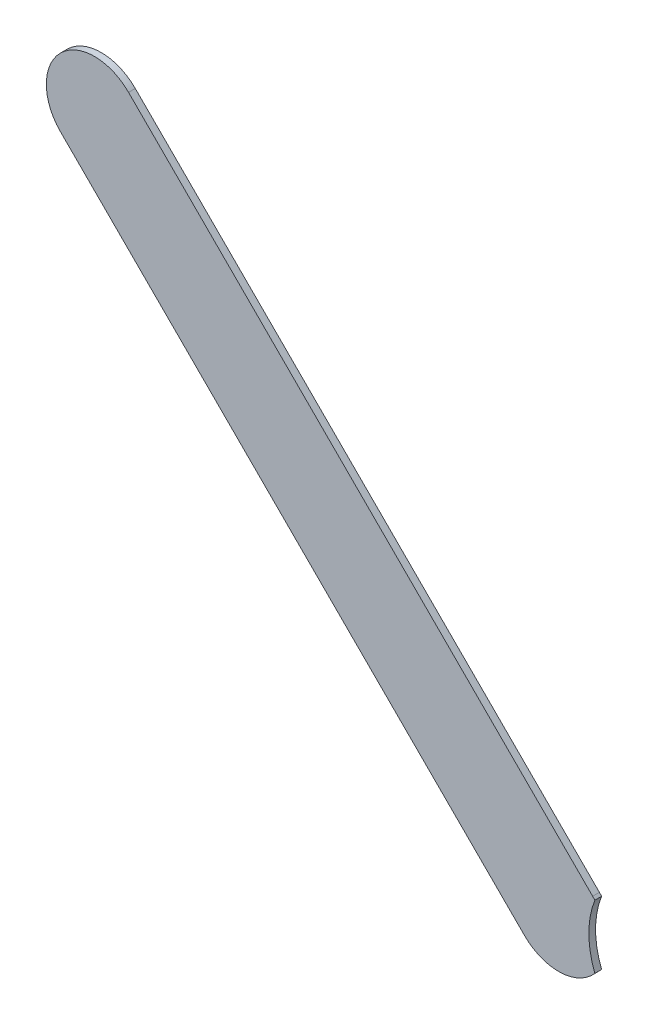
ISO-10303-21;
HEADER;
FILE_DESCRIPTION(('STEP AP214'),'2;1');
FILE_NAME('part.step','',(''),(''),'','','');
FILE_SCHEMA(('AUTOMOTIVE_DESIGN { 1 0 10303 214 1 1 1 1 }'));
ENDSEC;
DATA;
#1=APPLICATION_CONTEXT('core data for automotive mechanical design processes');
#2=APPLICATION_PROTOCOL_DEFINITION('international standard','automotive_design',2000,#1);
#3=PRODUCT_CONTEXT('',#1,'mechanical');
#4=PRODUCT('Part','Part','',(#3));
#5=PRODUCT_RELATED_PRODUCT_CATEGORY('part','',(#4));
#6=PRODUCT_DEFINITION_FORMATION('','',#4);
#7=PRODUCT_DEFINITION_CONTEXT('part definition',#1,'design');
#8=PRODUCT_DEFINITION('design','',#6,#7);
#9=PRODUCT_DEFINITION_SHAPE('','',#8);
#10=(LENGTH_UNIT() NAMED_UNIT(*) SI_UNIT(.MILLI.,.METRE.));
#11=(NAMED_UNIT(*) PLANE_ANGLE_UNIT() SI_UNIT($,.RADIAN.));
#12=(NAMED_UNIT(*) SI_UNIT($,.STERADIAN.) SOLID_ANGLE_UNIT());
#13=UNCERTAINTY_MEASURE_WITH_UNIT(LENGTH_MEASURE(1.E-05),#10,'distance_accuracy_value','');
#14=(GEOMETRIC_REPRESENTATION_CONTEXT(3) GLOBAL_UNCERTAINTY_ASSIGNED_CONTEXT((#13)) GLOBAL_UNIT_ASSIGNED_CONTEXT((#10,
#11,#12)) REPRESENTATION_CONTEXT('',''));
#15=CARTESIAN_POINT('',(0.,0.,0.));
#16=DIRECTION('',(0.,0.,1.));
#17=DIRECTION('',(1.,0.,0.));
#18=AXIS2_PLACEMENT_3D('',#15,#16,#17);
#19=CARTESIAN_POINT('',(176.6529995,-124.4559995,-0.035));
#20=DIRECTION('',(0.,0.,-1.));
#21=DIRECTION('',(-0.707106781186548,-0.707106781186548,0.));
#22=AXIS2_PLACEMENT_3D('',#19,#20,#21);
#23=CYLINDRICAL_SURFACE('',#22,0.249999723809);
#24=DIRECTION('',(0.,0.,1.));
#25=VECTOR('',#24,1.);
#26=CARTESIAN_POINT('',(176.829776,-124.279223,-0.035));
#27=LINE('',#26,#25);
#28=CARTESIAN_POINT('',(176.829776,-124.279223,-0.035));
#29=VERTEX_POINT('',#28);
#30=CARTESIAN_POINT('',(176.829776,-124.279223,0.));
#31=VERTEX_POINT('',#30);
#32=EDGE_CURVE('E27',#29,#31,#27,.T.);
#33=ORIENTED_EDGE('',*,*,#32,.T.);
#34=CARTESIAN_POINT('',(176.6529995,-124.4559995,0.));
#35=DIRECTION('',(0.,0.,1.));
#36=DIRECTION('',(-0.707106781186548,-0.707106781186548,0.));
#37=AXIS2_PLACEMENT_3D('',#34,#35,#36);
#38=CIRCLE('',#37,0.249999723809);
#39=CARTESIAN_POINT('',(176.84117861475,-124.2914137087,0.));
#40=VERTEX_POINT('',#39);
#41=EDGE_CURVE('E90',#40,#31,#38,.T.);
#42=ORIENTED_EDGE('',*,*,#41,.F.);
#43=DIRECTION('',(0.,0.,-1.));
#44=VECTOR('',#43,1.);
#45=CARTESIAN_POINT('',(176.84117861475,-124.2914137087,-0.035));
#46=LINE('',#45,#44);
#47=CARTESIAN_POINT('',(176.84117861475,-124.2914137087,-0.035));
#48=VERTEX_POINT('',#47);
#49=EDGE_CURVE('E11',#40,#48,#46,.T.);
#50=ORIENTED_EDGE('',*,*,#49,.T.);
#51=CARTESIAN_POINT('',(176.6529995,-124.4559995,-0.035));
#52=DIRECTION('',(0.,0.,1.));
#53=DIRECTION('',(-0.707106781186548,-0.707106781186548,0.));
#54=AXIS2_PLACEMENT_3D('',#51,#52,#53);
#55=CIRCLE('',#54,0.249999723809);
#56=EDGE_CURVE('E87',#48,#29,#55,.T.);
#57=ORIENTED_EDGE('',*,*,#56,.T.);
#58=EDGE_LOOP('',(#33,#42,#50,#57));
#59=FACE_BOUND('',#58,.T.);
#60=ADVANCED_FACE('F17',(#59),#23,.T.);
#61=CARTESIAN_POINT('',(177.26,-124.456,-0.045));
#62=DIRECTION('',(0.,0.,-1.));
#63=DIRECTION('',(0.,-1.,0.));
#64=AXIS2_PLACEMENT_3D('',#61,#62,#63);
#65=CYLINDRICAL_SURFACE('',#64,0.45);
#66=ORIENTED_EDGE('',*,*,#49,.F.);
#67=CARTESIAN_POINT('',(177.26,-124.456,0.));
#68=DIRECTION('',(0.,0.,-1.));
#69=DIRECTION('',(0.,-1.,0.));
#70=AXIS2_PLACEMENT_3D('',#67,#68,#69);
#71=CIRCLE('',#70,0.45);
#72=CARTESIAN_POINT('',(176.84117834361,-124.6205856012,0.));
#73=VERTEX_POINT('',#72);
#74=EDGE_CURVE('E97',#73,#40,#71,.T.);
#75=ORIENTED_EDGE('',*,*,#74,.F.);
#76=DIRECTION('',(0.,0.,-1.));
#77=VECTOR('',#76,1.);
#78=CARTESIAN_POINT('',(176.8411783436,-124.6205856012,-0.035));
#79=LINE('',#78,#77);
#80=CARTESIAN_POINT('',(176.84117834361,-124.6205856012,-0.035));
#81=VERTEX_POINT('',#80);
#82=EDGE_CURVE('E95',#73,#81,#79,.T.);
#83=ORIENTED_EDGE('',*,*,#82,.T.);
#84=CARTESIAN_POINT('',(177.26,-124.456,-0.035));
#85=DIRECTION('',(0.,0.,-1.));
#86=DIRECTION('',(0.,-1.,0.));
#87=AXIS2_PLACEMENT_3D('',#84,#85,#86);
#88=CIRCLE('',#87,0.45);
#89=EDGE_CURVE('E79',#81,#48,#88,.T.);
#90=ORIENTED_EDGE('',*,*,#89,.T.);
#91=EDGE_LOOP('',(#66,#75,#83,#90));
#92=FACE_BOUND('',#91,.T.);
#93=ADVANCED_FACE('F19',(#92),#65,.F.);
#94=CARTESIAN_POINT('',(176.829776,-124.279223,-0.035));
#95=DIRECTION('',(-0.707106781186548,-0.707106781186548,0.));
#96=DIRECTION('',(-0.707106781186548,0.707106781186548,0.));
#97=AXIS2_PLACEMENT_3D('',#94,#95,#96);
#98=PLANE('',#97);
#99=DIRECTION('',(-0.707106781186548,0.707106781186548,0.));
#100=VECTOR('',#99,1.);
#101=CARTESIAN_POINT('',(176.829776,-124.279223,-0.035));
#102=LINE('',#101,#100);
#103=CARTESIAN_POINT('',(174.420776,-121.870223,-0.035));
#104=VERTEX_POINT('',#103);
#105=EDGE_CURVE('E101',#29,#104,#102,.T.);
#106=ORIENTED_EDGE('',*,*,#105,.T.);
#107=DIRECTION('',(0.,0.,1.));
#108=VECTOR('',#107,1.);
#109=CARTESIAN_POINT('',(174.420776,-121.870223,-0.035));
#110=LINE('',#109,#108);
#111=CARTESIAN_POINT('',(174.420776,-121.870223,0.));
#112=VERTEX_POINT('',#111);
#113=EDGE_CURVE('E125',#104,#112,#110,.T.);
#114=ORIENTED_EDGE('',*,*,#113,.T.);
#115=DIRECTION('',(-0.707106781186548,0.707106781186548,0.));
#116=VECTOR('',#115,1.);
#117=CARTESIAN_POINT('',(176.829776,-124.279223,0.));
#118=LINE('',#117,#116);
#119=EDGE_CURVE('E116',#31,#112,#118,.T.);
#120=ORIENTED_EDGE('',*,*,#119,.F.);
#121=ORIENTED_EDGE('',*,*,#32,.F.);
#122=EDGE_LOOP('',(#106,#114,#120,#121));
#123=FACE_BOUND('',#122,.T.);
#124=ADVANCED_FACE('F195',(#123),#98,.F.);
#125=CARTESIAN_POINT('',(174.067223,-122.223776,0.));
#126=DIRECTION('',(0.,0.,1.));
#127=DIRECTION('',(1.,0.,0.));
#128=AXIS2_PLACEMENT_3D('',#125,#126,#127);
#129=PLANE('',#128);
#130=CARTESIAN_POINT('',(174.2439995,-122.0469995,0.));
#131=DIRECTION('',(0.,0.,1.));
#132=DIRECTION('',(0.707106781186548,0.707106781186548,0.));
#133=AXIS2_PLACEMENT_3D('',#130,#131,#132);
#134=CIRCLE('',#133,0.249999723809);
#135=CARTESIAN_POINT('',(174.067223,-122.223776,0.));
#136=VERTEX_POINT('',#135);
#137=EDGE_CURVE('E133',#112,#136,#134,.T.);
#138=ORIENTED_EDGE('',*,*,#137,.T.);
#139=DIRECTION('',(0.707106781186548,-0.707106781186548,0.));
#140=VECTOR('',#139,1.);
#141=CARTESIAN_POINT('',(174.067223,-122.223776,0.));
#142=LINE('',#141,#140);
#143=CARTESIAN_POINT('',(176.476223,-124.632776,0.));
#144=VERTEX_POINT('',#143);
#145=EDGE_CURVE('E117',#136,#144,#142,.T.);
#146=ORIENTED_EDGE('',*,*,#145,.T.);
#147=CARTESIAN_POINT('',(176.6529995,-124.4559995,0.));
#148=DIRECTION('',(0.,0.,1.));
#149=DIRECTION('',(-0.707106781186548,-0.707106781186548,0.));
#150=AXIS2_PLACEMENT_3D('',#147,#148,#149);
#151=CIRCLE('',#150,0.249999723809);
#152=EDGE_CURVE('E124',#144,#73,#151,.T.);
#153=ORIENTED_EDGE('',*,*,#152,.T.);
#154=ORIENTED_EDGE('',*,*,#74,.T.);
#155=ORIENTED_EDGE('',*,*,#41,.T.);
#156=ORIENTED_EDGE('',*,*,#119,.T.);
#157=EDGE_LOOP('',(#138,#146,#153,#154,#155,#156));
#158=FACE_BOUND('',#157,.T.);
#159=ADVANCED_FACE('F197',(#158),#129,.T.);
#160=CARTESIAN_POINT('',(174.067223,-122.223776,-0.035));
#161=DIRECTION('',(0.,0.,1.));
#162=DIRECTION('',(1.,0.,0.));
#163=AXIS2_PLACEMENT_3D('',#160,#161,#162);
#164=PLANE('',#163);
#165=ORIENTED_EDGE('',*,*,#105,.F.);
#166=ORIENTED_EDGE('',*,*,#56,.F.);
#167=ORIENTED_EDGE('',*,*,#89,.F.);
#168=CARTESIAN_POINT('',(176.6529995,-124.4559995,-0.035));
#169=DIRECTION('',(0.,0.,1.));
#170=DIRECTION('',(-0.707106781186548,-0.707106781186548,0.));
#171=AXIS2_PLACEMENT_3D('',#168,#169,#170);
#172=CIRCLE('',#171,0.249999723809);
#173=CARTESIAN_POINT('',(176.476223,-124.632776,-0.035));
#174=VERTEX_POINT('',#173);
#175=EDGE_CURVE('E108',#174,#81,#172,.T.);
#176=ORIENTED_EDGE('',*,*,#175,.F.);
#177=DIRECTION('',(0.707106781186548,-0.707106781186548,0.));
#178=VECTOR('',#177,1.);
#179=CARTESIAN_POINT('',(174.067223,-122.223776,-0.035));
#180=LINE('',#179,#178);
#181=CARTESIAN_POINT('',(174.067223,-122.223776,-0.035));
#182=VERTEX_POINT('',#181);
#183=EDGE_CURVE('E178',#182,#174,#180,.T.);
#184=ORIENTED_EDGE('',*,*,#183,.F.);
#185=CARTESIAN_POINT('',(174.2439995,-122.0469995,-0.035));
#186=DIRECTION('',(0.,0.,1.));
#187=DIRECTION('',(0.707106781186548,0.707106781186548,0.));
#188=AXIS2_PLACEMENT_3D('',#185,#186,#187);
#189=CIRCLE('',#188,0.249999723809);
#190=EDGE_CURVE('E129',#104,#182,#189,.T.);
#191=ORIENTED_EDGE('',*,*,#190,.F.);
#192=EDGE_LOOP('',(#165,#166,#167,#176,#184,#191));
#193=FACE_BOUND('',#192,.T.);
#194=ADVANCED_FACE('F99',(#193),#164,.F.);
#195=CARTESIAN_POINT('',(176.6529995,-124.4559995,-0.035));
#196=DIRECTION('',(0.,0.,-1.));
#197=DIRECTION('',(-0.707106781186548,-0.707106781186548,0.));
#198=AXIS2_PLACEMENT_3D('',#195,#196,#197);
#199=CYLINDRICAL_SURFACE('',#198,0.249999723809);
#200=ORIENTED_EDGE('',*,*,#82,.F.);
#201=ORIENTED_EDGE('',*,*,#152,.F.);
#202=DIRECTION('',(0.,0.,1.));
#203=VECTOR('',#202,1.);
#204=CARTESIAN_POINT('',(176.476223,-124.632776,-0.035));
#205=LINE('',#204,#203);
#206=EDGE_CURVE('E111',#174,#144,#205,.T.);
#207=ORIENTED_EDGE('',*,*,#206,.F.);
#208=ORIENTED_EDGE('',*,*,#175,.T.);
#209=EDGE_LOOP('',(#200,#201,#207,#208));
#210=FACE_BOUND('',#209,.T.);
#211=ADVANCED_FACE('F199',(#210),#199,.T.);
#212=CARTESIAN_POINT('',(174.2439995,-122.0469995,-0.035));
#213=DIRECTION('',(0.,0.,-1.));
#214=DIRECTION('',(0.707106781186548,0.707106781186548,0.));
#215=AXIS2_PLACEMENT_3D('',#212,#213,#214);
#216=CYLINDRICAL_SURFACE('',#215,0.249999723809);
#217=ORIENTED_EDGE('',*,*,#190,.T.);
#218=DIRECTION('',(0.,0.,1.));
#219=VECTOR('',#218,1.);
#220=CARTESIAN_POINT('',(174.067223,-122.223776,-0.035));
#221=LINE('',#220,#219);
#222=EDGE_CURVE('E121',#182,#136,#221,.T.);
#223=ORIENTED_EDGE('',*,*,#222,.T.);
#224=ORIENTED_EDGE('',*,*,#137,.F.);
#225=ORIENTED_EDGE('',*,*,#113,.F.);
#226=EDGE_LOOP('',(#217,#223,#224,#225));
#227=FACE_BOUND('',#226,.T.);
#228=ADVANCED_FACE('F193',(#227),#216,.T.);
#229=CARTESIAN_POINT('',(174.067223,-122.223776,-0.035));
#230=DIRECTION('',(0.707106781186548,0.707106781186548,0.));
#231=DIRECTION('',(0.,0.,-1.));
#232=AXIS2_PLACEMENT_3D('',#229,#230,#231);
#233=PLANE('',#232);
#234=ORIENTED_EDGE('',*,*,#183,.T.);
#235=ORIENTED_EDGE('',*,*,#206,.T.);
#236=ORIENTED_EDGE('',*,*,#145,.F.);
#237=ORIENTED_EDGE('',*,*,#222,.F.);
#238=EDGE_LOOP('',(#234,#235,#236,#237));
#239=FACE_BOUND('',#238,.T.);
#240=ADVANCED_FACE('F187',(#239),#233,.F.);
#241=CLOSED_SHELL('',(#60,#93,#124,#159,#194,#211,#228,#240));
#242=MANIFOLD_SOLID_BREP('B1',#241);
#243=ADVANCED_BREP_SHAPE_REPRESENTATION('',(#18,#242),#14);
#244=SHAPE_DEFINITION_REPRESENTATION(#9,#243);
ENDSEC;
END-ISO-10303-21;
